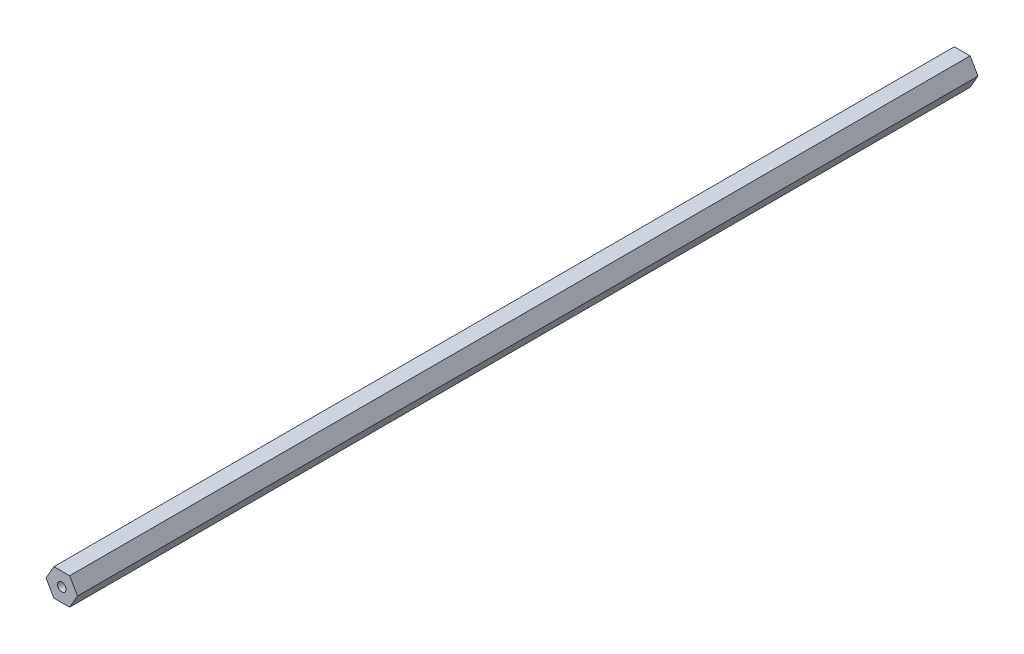
ISO-10303-21;
HEADER;
FILE_DESCRIPTION(('STEP AP214'),'2;1');
FILE_NAME('part.step','',(''),(''),'','','');
FILE_SCHEMA(('AUTOMOTIVE_DESIGN { 1 0 10303 214 1 1 1 1 }'));
ENDSEC;
DATA;
#1=APPLICATION_CONTEXT('core data for automotive mechanical design processes');
#2=APPLICATION_PROTOCOL_DEFINITION('international standard','automotive_design',2000,#1);
#3=PRODUCT_CONTEXT('',#1,'mechanical');
#4=PRODUCT('Part','Part','',(#3));
#5=PRODUCT_RELATED_PRODUCT_CATEGORY('part','',(#4));
#6=PRODUCT_DEFINITION_FORMATION('','',#4);
#7=PRODUCT_DEFINITION_CONTEXT('part definition',#1,'design');
#8=PRODUCT_DEFINITION('design','',#6,#7);
#9=PRODUCT_DEFINITION_SHAPE('','',#8);
#10=(LENGTH_UNIT() NAMED_UNIT(*) SI_UNIT(.MILLI.,.METRE.));
#11=(NAMED_UNIT(*) PLANE_ANGLE_UNIT() SI_UNIT($,.RADIAN.));
#12=(NAMED_UNIT(*) SI_UNIT($,.STERADIAN.) SOLID_ANGLE_UNIT());
#13=UNCERTAINTY_MEASURE_WITH_UNIT(LENGTH_MEASURE(1.E-05),#10,'distance_accuracy_value','');
#14=(GEOMETRIC_REPRESENTATION_CONTEXT(3) GLOBAL_UNCERTAINTY_ASSIGNED_CONTEXT((#13)) GLOBAL_UNIT_ASSIGNED_CONTEXT((#10,
#11,#12)) REPRESENTATION_CONTEXT('',''));
#15=CARTESIAN_POINT('',(0.,0.,0.));
#16=DIRECTION('',(0.,0.,1.));
#17=DIRECTION('',(1.,0.,0.));
#18=AXIS2_PLACEMENT_3D('',#15,#16,#17);
#19=CARTESIAN_POINT('',(38.3448822639292,0.00465053802825576,-419.1));
#20=DIRECTION('',(0.,0.,1.));
#21=DIRECTION('',(1.,0.,0.));
#22=AXIS2_PLACEMENT_3D('',#19,#20,#21);
#23=PLANE('',#22);
#24=CARTESIAN_POINT('',(38.3448822639292,0.00465053802825777,-419.1));
#25=DIRECTION('',(0.,0.,1.));
#26=DIRECTION('',(-1.,0.,0.));
#27=AXIS2_PLACEMENT_3D('',#24,#25,#26);
#28=CIRCLE('',#27,2.0193);
#29=CARTESIAN_POINT('',(40.3641822639292,0.004650538028258,-419.1));
#30=VERTEX_POINT('',#29);
#31=EDGE_CURVE('E199',#30,#30,#28,.T.);
#32=ORIENTED_EDGE('',*,*,#31,.T.);
#33=EDGE_LOOP('',(#32));
#34=FACE_BOUND('',#33,.T.);
#35=DIRECTION('',(0.5,0.866025403784439,0.));
#36=VECTOR('',#35,1.);
#37=CARTESIAN_POINT('',(34.678708054575,6.35465053802824,-419.1));
#38=LINE('',#37,#36);
#39=CARTESIAN_POINT('',(31.0125338452207,0.00465053802825467,-419.1));
#40=VERTEX_POINT('',#39);
#41=CARTESIAN_POINT('',(34.678708054575,6.35465053802824,-419.1));
#42=VERTEX_POINT('',#41);
#43=EDGE_CURVE('E11',#40,#42,#38,.T.);
#44=ORIENTED_EDGE('',*,*,#43,.T.);
#45=DIRECTION('',(1.,0.,0.));
#46=VECTOR('',#45,1.);
#47=CARTESIAN_POINT('',(42.0110564732832,6.35465053802827,-419.1));
#48=LINE('',#47,#46);
#49=CARTESIAN_POINT('',(42.0110564732832,6.35465053802827,-419.1));
#50=VERTEX_POINT('',#49);
#51=EDGE_CURVE('E86',#42,#50,#48,.T.);
#52=ORIENTED_EDGE('',*,*,#51,.T.);
#53=DIRECTION('',(0.5,-0.866025403784438,0.));
#54=VECTOR('',#53,1.);
#55=CARTESIAN_POINT('',(45.6772306826374,0.00465053802825909,-419.1));
#56=LINE('',#55,#54);
#57=CARTESIAN_POINT('',(45.6772306826374,0.00465053802825909,-419.1));
#58=VERTEX_POINT('',#57);
#59=EDGE_CURVE('E89',#50,#58,#56,.T.);
#60=ORIENTED_EDGE('',*,*,#59,.T.);
#61=DIRECTION('',(-0.5,-0.866025403784439,0.));
#62=VECTOR('',#61,1.);
#63=CARTESIAN_POINT('',(42.0110564732832,-6.34534946197173,-419.1));
#64=LINE('',#63,#62);
#65=CARTESIAN_POINT('',(42.0110564732832,-6.34534946197173,-419.1));
#66=VERTEX_POINT('',#65);
#67=EDGE_CURVE('E148',#58,#66,#64,.T.);
#68=ORIENTED_EDGE('',*,*,#67,.T.);
#69=DIRECTION('',(-1.,0.,0.));
#70=VECTOR('',#69,1.);
#71=CARTESIAN_POINT('',(34.678708054575,-6.34534946197176,-419.1));
#72=LINE('',#71,#70);
#73=CARTESIAN_POINT('',(34.678708054575,-6.34534946197176,-419.1));
#74=VERTEX_POINT('',#73);
#75=EDGE_CURVE('E142',#66,#74,#72,.T.);
#76=ORIENTED_EDGE('',*,*,#75,.T.);
#77=DIRECTION('',(-0.5,0.866025403784439,0.));
#78=VECTOR('',#77,1.);
#79=CARTESIAN_POINT('',(31.0125338452207,0.00465053802825467,-419.1));
#80=LINE('',#79,#78);
#81=EDGE_CURVE('E125',#74,#40,#80,.T.);
#82=ORIENTED_EDGE('',*,*,#81,.T.);
#83=EDGE_LOOP('',(#44,#52,#60,#68,#76,#82));
#84=FACE_BOUND('',#83,.T.);
#85=ADVANCED_FACE('F17',(#34,#84),#23,.F.);
#86=CARTESIAN_POINT('',(38.3448822639292,0.00465053802825576,0.));
#87=DIRECTION('',(0.,0.,1.));
#88=DIRECTION('',(1.,0.,0.));
#89=AXIS2_PLACEMENT_3D('',#86,#87,#88);
#90=PLANE('',#89);
#91=CARTESIAN_POINT('',(38.3448822639292,0.00465053802825777,0.));
#92=DIRECTION('',(0.,0.,-1.));
#93=DIRECTION('',(-1.,0.,0.));
#94=AXIS2_PLACEMENT_3D('',#91,#92,#93);
#95=CIRCLE('',#94,2.0193);
#96=CARTESIAN_POINT('',(40.3641822639292,0.00465053802825802,0.));
#97=VERTEX_POINT('',#96);
#98=EDGE_CURVE('E129',#97,#97,#95,.T.);
#99=ORIENTED_EDGE('',*,*,#98,.T.);
#100=EDGE_LOOP('',(#99));
#101=FACE_BOUND('',#100,.T.);
#102=DIRECTION('',(-0.5,-0.866025403784439,0.));
#103=VECTOR('',#102,1.);
#104=CARTESIAN_POINT('',(34.678708054575,6.35465053802824,0.));
#105=LINE('',#104,#103);
#106=CARTESIAN_POINT('',(34.678708054575,6.35465053802824,0.));
#107=VERTEX_POINT('',#106);
#108=CARTESIAN_POINT('',(31.0125338452207,0.00465053802825467,0.));
#109=VERTEX_POINT('',#108);
#110=EDGE_CURVE('E26',#107,#109,#105,.T.);
#111=ORIENTED_EDGE('',*,*,#110,.T.);
#112=DIRECTION('',(0.5,-0.866025403784439,0.));
#113=VECTOR('',#112,1.);
#114=CARTESIAN_POINT('',(31.0125338452207,0.00465053802825467,0.));
#115=LINE('',#114,#113);
#116=CARTESIAN_POINT('',(34.678708054575,-6.34534946197176,0.));
#117=VERTEX_POINT('',#116);
#118=EDGE_CURVE('E132',#109,#117,#115,.T.);
#119=ORIENTED_EDGE('',*,*,#118,.T.);
#120=DIRECTION('',(1.,0.,0.));
#121=VECTOR('',#120,1.);
#122=CARTESIAN_POINT('',(34.678708054575,-6.34534946197176,0.));
#123=LINE('',#122,#121);
#124=CARTESIAN_POINT('',(42.0110564732832,-6.34534946197173,0.));
#125=VERTEX_POINT('',#124);
#126=EDGE_CURVE('E124',#117,#125,#123,.T.);
#127=ORIENTED_EDGE('',*,*,#126,.T.);
#128=DIRECTION('',(0.5,0.866025403784439,0.));
#129=VECTOR('',#128,1.);
#130=CARTESIAN_POINT('',(42.0110564732832,-6.34534946197173,0.));
#131=LINE('',#130,#129);
#132=CARTESIAN_POINT('',(45.6772306826374,0.00465053802825909,0.));
#133=VERTEX_POINT('',#132);
#134=EDGE_CURVE('E151',#125,#133,#131,.T.);
#135=ORIENTED_EDGE('',*,*,#134,.T.);
#136=DIRECTION('',(-0.5,0.866025403784438,0.));
#137=VECTOR('',#136,1.);
#138=CARTESIAN_POINT('',(45.6772306826374,0.00465053802825909,0.));
#139=LINE('',#138,#137);
#140=CARTESIAN_POINT('',(42.0110564732832,6.35465053802827,0.));
#141=VERTEX_POINT('',#140);
#142=EDGE_CURVE('E110',#133,#141,#139,.T.);
#143=ORIENTED_EDGE('',*,*,#142,.T.);
#144=DIRECTION('',(-1.,0.,0.));
#145=VECTOR('',#144,1.);
#146=CARTESIAN_POINT('',(42.0110564732832,6.35465053802827,0.));
#147=LINE('',#146,#145);
#148=EDGE_CURVE('E95',#141,#107,#147,.T.);
#149=ORIENTED_EDGE('',*,*,#148,.T.);
#150=EDGE_LOOP('',(#111,#119,#127,#135,#143,#149));
#151=FACE_BOUND('',#150,.T.);
#152=ADVANCED_FACE('F165',(#101,#151),#90,.T.);
#153=CARTESIAN_POINT('',(31.0125338452207,0.00465053802825467,0.));
#154=DIRECTION('',(-0.866025403784439,0.5,0.));
#155=DIRECTION('',(0.,0.,1.));
#156=AXIS2_PLACEMENT_3D('',#153,#154,#155);
#157=PLANE('',#156);
#158=ORIENTED_EDGE('',*,*,#110,.F.);
#159=DIRECTION('',(0.,0.,-1.));
#160=VECTOR('',#159,1.);
#161=CARTESIAN_POINT('',(34.678708054575,6.35465053802824,0.));
#162=LINE('',#161,#160);
#163=EDGE_CURVE('E94',#107,#42,#162,.T.);
#164=ORIENTED_EDGE('',*,*,#163,.T.);
#165=ORIENTED_EDGE('',*,*,#43,.F.);
#166=DIRECTION('',(0.,0.,-1.));
#167=VECTOR('',#166,1.);
#168=CARTESIAN_POINT('',(31.0125338452207,0.00465053802825467,0.));
#169=LINE('',#168,#167);
#170=EDGE_CURVE('E128',#109,#40,#169,.T.);
#171=ORIENTED_EDGE('',*,*,#170,.F.);
#172=EDGE_LOOP('',(#158,#164,#165,#171));
#173=FACE_BOUND('',#172,.T.);
#174=ADVANCED_FACE('F168',(#173),#157,.T.);
#175=CARTESIAN_POINT('',(34.678708054575,6.35465053802824,0.));
#176=DIRECTION('',(0.,1.,0.));
#177=DIRECTION('',(1.,0.,0.));
#178=AXIS2_PLACEMENT_3D('',#175,#176,#177);
#179=PLANE('',#178);
#180=ORIENTED_EDGE('',*,*,#148,.F.);
#181=DIRECTION('',(0.,0.,-1.));
#182=VECTOR('',#181,1.);
#183=CARTESIAN_POINT('',(42.0110564732832,6.35465053802827,0.));
#184=LINE('',#183,#182);
#185=EDGE_CURVE('E98',#141,#50,#184,.T.);
#186=ORIENTED_EDGE('',*,*,#185,.T.);
#187=ORIENTED_EDGE('',*,*,#51,.F.);
#188=ORIENTED_EDGE('',*,*,#163,.F.);
#189=EDGE_LOOP('',(#180,#186,#187,#188));
#190=FACE_BOUND('',#189,.T.);
#191=ADVANCED_FACE('F99',(#190),#179,.T.);
#192=CARTESIAN_POINT('',(42.0110564732832,6.35465053802827,0.));
#193=DIRECTION('',(0.866025403784438,0.5,0.));
#194=DIRECTION('',(0.,0.,-1.));
#195=AXIS2_PLACEMENT_3D('',#192,#193,#194);
#196=PLANE('',#195);
#197=ORIENTED_EDGE('',*,*,#142,.F.);
#198=DIRECTION('',(0.,0.,-1.));
#199=VECTOR('',#198,1.);
#200=CARTESIAN_POINT('',(45.6772306826374,0.00465053802825909,0.));
#201=LINE('',#200,#199);
#202=EDGE_CURVE('E107',#133,#58,#201,.T.);
#203=ORIENTED_EDGE('',*,*,#202,.T.);
#204=ORIENTED_EDGE('',*,*,#59,.F.);
#205=ORIENTED_EDGE('',*,*,#185,.F.);
#206=EDGE_LOOP('',(#197,#203,#204,#205));
#207=FACE_BOUND('',#206,.T.);
#208=ADVANCED_FACE('F105',(#207),#196,.T.);
#209=CARTESIAN_POINT('',(45.6772306826374,0.00465053802825909,0.));
#210=DIRECTION('',(0.866025403784439,-0.5,0.));
#211=DIRECTION('',(0.,0.,-1.));
#212=AXIS2_PLACEMENT_3D('',#209,#210,#211);
#213=PLANE('',#212);
#214=ORIENTED_EDGE('',*,*,#134,.F.);
#215=DIRECTION('',(0.,0.,-1.));
#216=VECTOR('',#215,1.);
#217=CARTESIAN_POINT('',(42.0110564732832,-6.34534946197173,0.));
#218=LINE('',#217,#216);
#219=EDGE_CURVE('E145',#125,#66,#218,.T.);
#220=ORIENTED_EDGE('',*,*,#219,.T.);
#221=ORIENTED_EDGE('',*,*,#67,.F.);
#222=ORIENTED_EDGE('',*,*,#202,.F.);
#223=EDGE_LOOP('',(#214,#220,#221,#222));
#224=FACE_BOUND('',#223,.T.);
#225=ADVANCED_FACE('F178',(#224),#213,.T.);
#226=CARTESIAN_POINT('',(42.0110564732832,-6.34534946197173,0.));
#227=DIRECTION('',(0.,-1.,0.));
#228=DIRECTION('',(0.,0.,-1.));
#229=AXIS2_PLACEMENT_3D('',#226,#227,#228);
#230=PLANE('',#229);
#231=ORIENTED_EDGE('',*,*,#126,.F.);
#232=DIRECTION('',(0.,0.,-1.));
#233=VECTOR('',#232,1.);
#234=CARTESIAN_POINT('',(34.678708054575,-6.34534946197176,0.));
#235=LINE('',#234,#233);
#236=EDGE_CURVE('E121',#117,#74,#235,.T.);
#237=ORIENTED_EDGE('',*,*,#236,.T.);
#238=ORIENTED_EDGE('',*,*,#75,.F.);
#239=ORIENTED_EDGE('',*,*,#219,.F.);
#240=EDGE_LOOP('',(#231,#237,#238,#239));
#241=FACE_BOUND('',#240,.T.);
#242=ADVANCED_FACE('F175',(#241),#230,.T.);
#243=CARTESIAN_POINT('',(34.678708054575,-6.34534946197176,0.));
#244=DIRECTION('',(-0.866025403784439,-0.5,0.));
#245=DIRECTION('',(-0.5,0.866025403784439,0.));
#246=AXIS2_PLACEMENT_3D('',#243,#244,#245);
#247=PLANE('',#246);
#248=ORIENTED_EDGE('',*,*,#118,.F.);
#249=ORIENTED_EDGE('',*,*,#170,.T.);
#250=ORIENTED_EDGE('',*,*,#81,.F.);
#251=ORIENTED_EDGE('',*,*,#236,.F.);
#252=EDGE_LOOP('',(#248,#249,#250,#251));
#253=FACE_BOUND('',#252,.T.);
#254=ADVANCED_FACE('F172',(#253),#247,.T.);
#255=CARTESIAN_POINT('',(38.3448822639292,0.00465053802825777,0.));
#256=DIRECTION('',(0.,0.,-1.));
#257=DIRECTION('',(-1.,0.,0.));
#258=AXIS2_PLACEMENT_3D('',#255,#256,#257);
#259=CYLINDRICAL_SURFACE('',#258,2.0193);
#260=ORIENTED_EDGE('',*,*,#31,.F.);
#261=DIRECTION('',(0.,0.,1.));
#262=VECTOR('',#261,1.);
#263=CARTESIAN_POINT('',(40.3641822639292,0.00465053802825751,0.));
#264=LINE('',#263,#262);
#265=EDGE_CURVE('E119',#30,#97,#264,.T.);
#266=ORIENTED_EDGE('',*,*,#265,.T.);
#267=ORIENTED_EDGE('',*,*,#98,.F.);
#268=ORIENTED_EDGE('',*,*,#265,.F.);
#269=EDGE_LOOP('',(#260,#266,#267,#268));
#270=FACE_BOUND('',#269,.T.);
#271=ADVANCED_FACE('F206',(#270),#259,.F.);
#272=CLOSED_SHELL('',(#85,#152,#174,#191,#208,#225,#242,#254,#271));
#273=MANIFOLD_SOLID_BREP('B1',#272);
#274=ADVANCED_BREP_SHAPE_REPRESENTATION('',(#18,#273),#14);
#275=SHAPE_DEFINITION_REPRESENTATION(#9,#274);
ENDSEC;
END-ISO-10303-21;
